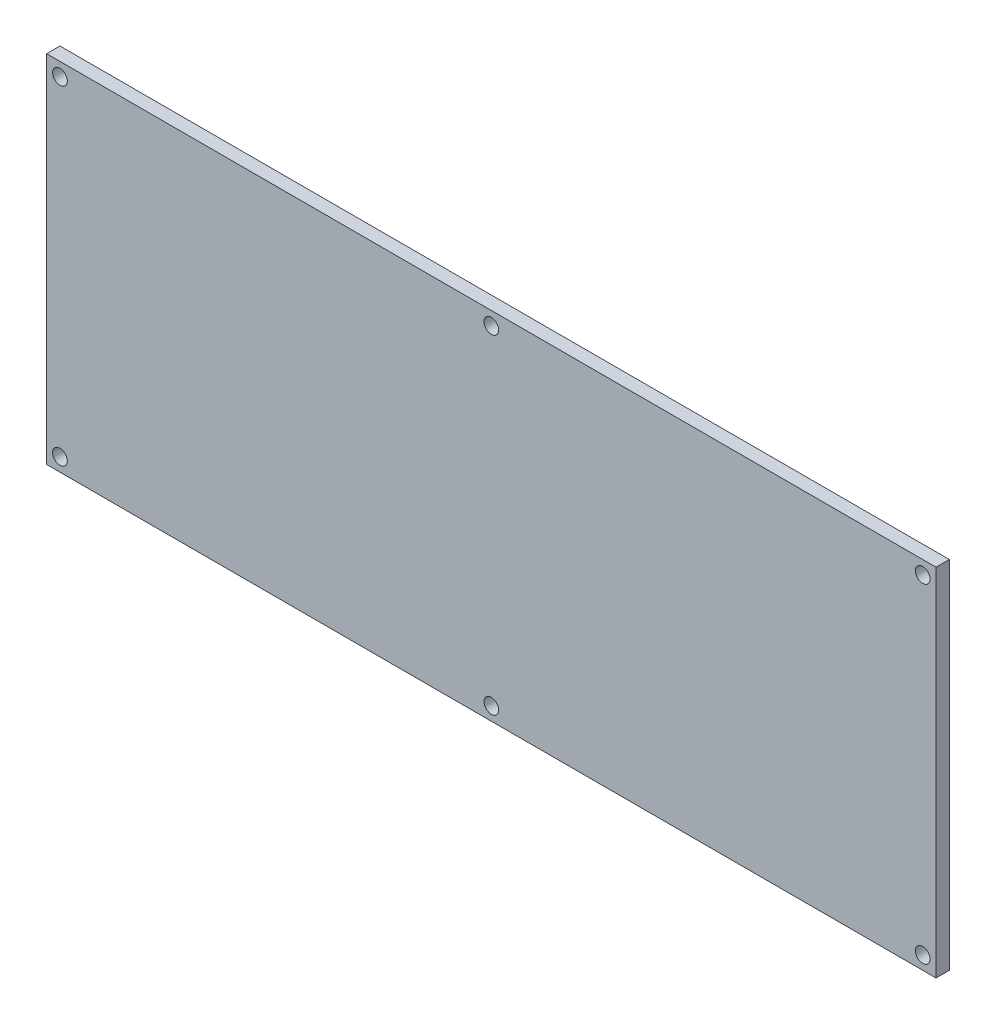
ISO-10303-21;
HEADER;
FILE_DESCRIPTION(('STEP AP214'),'2;1');
FILE_NAME('part.step','',(''),(''),'','','');
FILE_SCHEMA(('AUTOMOTIVE_DESIGN { 1 0 10303 214 1 1 1 1 }'));
ENDSEC;
DATA;
#1=APPLICATION_CONTEXT('core data for automotive mechanical design processes');
#2=APPLICATION_PROTOCOL_DEFINITION('international standard','automotive_design',2000,#1);
#3=PRODUCT_CONTEXT('',#1,'mechanical');
#4=PRODUCT('Part','Part','',(#3));
#5=PRODUCT_RELATED_PRODUCT_CATEGORY('part','',(#4));
#6=PRODUCT_DEFINITION_FORMATION('','',#4);
#7=PRODUCT_DEFINITION_CONTEXT('part definition',#1,'design');
#8=PRODUCT_DEFINITION('design','',#6,#7);
#9=PRODUCT_DEFINITION_SHAPE('','',#8);
#10=(LENGTH_UNIT() NAMED_UNIT(*) SI_UNIT(.MILLI.,.METRE.));
#11=(NAMED_UNIT(*) PLANE_ANGLE_UNIT() SI_UNIT($,.RADIAN.));
#12=(NAMED_UNIT(*) SI_UNIT($,.STERADIAN.) SOLID_ANGLE_UNIT());
#13=UNCERTAINTY_MEASURE_WITH_UNIT(LENGTH_MEASURE(1.E-05),#10,'distance_accuracy_value','');
#14=(GEOMETRIC_REPRESENTATION_CONTEXT(3) GLOBAL_UNCERTAINTY_ASSIGNED_CONTEXT((#13)) GLOBAL_UNIT_ASSIGNED_CONTEXT((#10,
#11,#12)) REPRESENTATION_CONTEXT('',''));
#15=CARTESIAN_POINT('',(0.,0.,0.));
#16=DIRECTION('',(0.,0.,1.));
#17=DIRECTION('',(1.,0.,0.));
#18=AXIS2_PLACEMENT_3D('',#15,#16,#17);
#19=CARTESIAN_POINT('',(0.,0.,3.));
#20=DIRECTION('',(0.,0.,-1.));
#21=DIRECTION('',(-1.,0.,0.));
#22=AXIS2_PLACEMENT_3D('',#19,#20,#21);
#23=PLANE('',#22);
#24=DIRECTION('',(0.,-1.,0.));
#25=VECTOR('',#24,1.);
#26=CARTESIAN_POINT('',(-100.,40.,3.));
#27=LINE('',#26,#25);
#28=CARTESIAN_POINT('',(-100.,40.,3.));
#29=VERTEX_POINT('',#28);
#30=CARTESIAN_POINT('',(-100.,-40.,3.));
#31=VERTEX_POINT('',#30);
#32=EDGE_CURVE('E87',#29,#31,#27,.T.);
#33=ORIENTED_EDGE('',*,*,#32,.T.);
#34=DIRECTION('',(1.,0.,0.));
#35=VECTOR('',#34,1.);
#36=CARTESIAN_POINT('',(100.,-40.,3.));
#37=LINE('',#36,#35);
#38=CARTESIAN_POINT('',(100.,-40.,3.));
#39=VERTEX_POINT('',#38);
#40=EDGE_CURVE('E82',#31,#39,#37,.T.);
#41=ORIENTED_EDGE('',*,*,#40,.T.);
#42=DIRECTION('',(0.,1.,0.));
#43=VECTOR('',#42,1.);
#44=CARTESIAN_POINT('',(100.,40.,3.));
#45=LINE('',#44,#43);
#46=CARTESIAN_POINT('',(100.,40.,3.));
#47=VERTEX_POINT('',#46);
#48=EDGE_CURVE('E85',#39,#47,#45,.T.);
#49=ORIENTED_EDGE('',*,*,#48,.T.);
#50=DIRECTION('',(-1.,0.,0.));
#51=VECTOR('',#50,1.);
#52=CARTESIAN_POINT('',(100.,40.,3.));
#53=LINE('',#52,#51);
#54=EDGE_CURVE('E52',#47,#29,#53,.T.);
#55=ORIENTED_EDGE('',*,*,#54,.T.);
#56=EDGE_LOOP('',(#33,#41,#49,#55));
#57=FACE_BOUND('',#56,.T.);
#58=CARTESIAN_POINT('',(-97.,37.,3.));
#59=DIRECTION('',(0.,0.,1.));
#60=DIRECTION('',(1.,0.,0.));
#61=AXIS2_PLACEMENT_3D('',#58,#59,#60);
#62=CIRCLE('',#61,1.65);
#63=CARTESIAN_POINT('',(-95.35,37.,3.));
#64=VERTEX_POINT('',#63);
#65=EDGE_CURVE('E102',#64,#64,#62,.T.);
#66=ORIENTED_EDGE('',*,*,#65,.F.);
#67=EDGE_LOOP('',(#66));
#68=FACE_BOUND('',#67,.T.);
#69=CARTESIAN_POINT('',(0.,37.,3.));
#70=DIRECTION('',(0.,0.,1.));
#71=DIRECTION('',(1.,0.,0.));
#72=AXIS2_PLACEMENT_3D('',#69,#70,#71);
#73=CIRCLE('',#72,1.65);
#74=CARTESIAN_POINT('',(1.65,37.,3.));
#75=VERTEX_POINT('',#74);
#76=EDGE_CURVE('E117',#75,#75,#73,.T.);
#77=ORIENTED_EDGE('',*,*,#76,.F.);
#78=EDGE_LOOP('',(#77));
#79=FACE_BOUND('',#78,.T.);
#80=CARTESIAN_POINT('',(97.,37.,3.));
#81=DIRECTION('',(0.,0.,1.));
#82=DIRECTION('',(1.,0.,0.));
#83=AXIS2_PLACEMENT_3D('',#80,#81,#82);
#84=CIRCLE('',#83,1.65);
#85=CARTESIAN_POINT('',(98.65,37.,3.));
#86=VERTEX_POINT('',#85);
#87=EDGE_CURVE('E123',#86,#86,#84,.T.);
#88=ORIENTED_EDGE('',*,*,#87,.F.);
#89=EDGE_LOOP('',(#88));
#90=FACE_BOUND('',#89,.T.);
#91=CARTESIAN_POINT('',(-97.,-37.,3.));
#92=DIRECTION('',(0.,0.,1.));
#93=DIRECTION('',(-1.,0.,0.));
#94=AXIS2_PLACEMENT_3D('',#91,#92,#93);
#95=CIRCLE('',#94,1.65);
#96=CARTESIAN_POINT('',(-98.65,-37.,3.));
#97=VERTEX_POINT('',#96);
#98=EDGE_CURVE('E129',#97,#97,#95,.T.);
#99=ORIENTED_EDGE('',*,*,#98,.F.);
#100=EDGE_LOOP('',(#99));
#101=FACE_BOUND('',#100,.T.);
#102=CARTESIAN_POINT('',(0.,-37.,3.));
#103=DIRECTION('',(0.,0.,1.));
#104=DIRECTION('',(-1.,0.,0.));
#105=AXIS2_PLACEMENT_3D('',#102,#103,#104);
#106=CIRCLE('',#105,1.65);
#107=CARTESIAN_POINT('',(-1.65,-37.,3.));
#108=VERTEX_POINT('',#107);
#109=EDGE_CURVE('E135',#108,#108,#106,.T.);
#110=ORIENTED_EDGE('',*,*,#109,.F.);
#111=EDGE_LOOP('',(#110));
#112=FACE_BOUND('',#111,.T.);
#113=CARTESIAN_POINT('',(97.,-37.,3.));
#114=DIRECTION('',(0.,0.,1.));
#115=DIRECTION('',(-1.,0.,0.));
#116=AXIS2_PLACEMENT_3D('',#113,#114,#115);
#117=CIRCLE('',#116,1.65);
#118=CARTESIAN_POINT('',(95.35,-37.,3.));
#119=VERTEX_POINT('',#118);
#120=EDGE_CURVE('E141',#119,#119,#117,.T.);
#121=ORIENTED_EDGE('',*,*,#120,.F.);
#122=EDGE_LOOP('',(#121));
#123=FACE_BOUND('',#122,.T.);
#124=ADVANCED_FACE('F35',(#57,#68,#79,#90,#101,#112,#123),#23,.F.);
#125=CARTESIAN_POINT('',(0.,0.,0.));
#126=DIRECTION('',(0.,0.,-1.));
#127=DIRECTION('',(-1.,0.,0.));
#128=AXIS2_PLACEMENT_3D('',#125,#126,#127);
#129=PLANE('',#128);
#130=CARTESIAN_POINT('',(0.,-37.,0.));
#131=DIRECTION('',(0.,0.,1.));
#132=DIRECTION('',(-1.,0.,0.));
#133=AXIS2_PLACEMENT_3D('',#130,#131,#132);
#134=CIRCLE('',#133,1.65);
#135=CARTESIAN_POINT('',(-1.65,-37.,0.));
#136=VERTEX_POINT('',#135);
#137=EDGE_CURVE('E138',#136,#136,#134,.T.);
#138=ORIENTED_EDGE('',*,*,#137,.T.);
#139=EDGE_LOOP('',(#138));
#140=FACE_BOUND('',#139,.T.);
#141=CARTESIAN_POINT('',(97.,37.,0.));
#142=DIRECTION('',(0.,0.,1.));
#143=DIRECTION('',(1.,0.,0.));
#144=AXIS2_PLACEMENT_3D('',#141,#142,#143);
#145=CIRCLE('',#144,1.65);
#146=CARTESIAN_POINT('',(98.65,37.,0.));
#147=VERTEX_POINT('',#146);
#148=EDGE_CURVE('E126',#147,#147,#145,.T.);
#149=ORIENTED_EDGE('',*,*,#148,.T.);
#150=EDGE_LOOP('',(#149));
#151=FACE_BOUND('',#150,.T.);
#152=CARTESIAN_POINT('',(-97.,37.,0.));
#153=DIRECTION('',(0.,0.,1.));
#154=DIRECTION('',(1.,0.,0.));
#155=AXIS2_PLACEMENT_3D('',#152,#153,#154);
#156=CIRCLE('',#155,1.65);
#157=CARTESIAN_POINT('',(-95.35,37.,0.));
#158=VERTEX_POINT('',#157);
#159=EDGE_CURVE('E114',#158,#158,#156,.T.);
#160=ORIENTED_EDGE('',*,*,#159,.T.);
#161=EDGE_LOOP('',(#160));
#162=FACE_BOUND('',#161,.T.);
#163=DIRECTION('',(0.,-1.,0.));
#164=VECTOR('',#163,1.);
#165=CARTESIAN_POINT('',(-100.,40.,0.));
#166=LINE('',#165,#164);
#167=CARTESIAN_POINT('',(-100.,40.,0.));
#168=VERTEX_POINT('',#167);
#169=CARTESIAN_POINT('',(-100.,-40.,0.));
#170=VERTEX_POINT('',#169);
#171=EDGE_CURVE('E99',#168,#170,#166,.T.);
#172=ORIENTED_EDGE('',*,*,#171,.F.);
#173=DIRECTION('',(-1.,0.,0.));
#174=VECTOR('',#173,1.);
#175=CARTESIAN_POINT('',(100.,40.,0.));
#176=LINE('',#175,#174);
#177=CARTESIAN_POINT('',(100.,40.,0.));
#178=VERTEX_POINT('',#177);
#179=EDGE_CURVE('E75',#178,#168,#176,.T.);
#180=ORIENTED_EDGE('',*,*,#179,.F.);
#181=DIRECTION('',(0.,1.,0.));
#182=VECTOR('',#181,1.);
#183=CARTESIAN_POINT('',(100.,40.,0.));
#184=LINE('',#183,#182);
#185=CARTESIAN_POINT('',(100.,-40.,0.));
#186=VERTEX_POINT('',#185);
#187=EDGE_CURVE('E69',#186,#178,#184,.T.);
#188=ORIENTED_EDGE('',*,*,#187,.F.);
#189=DIRECTION('',(1.,0.,0.));
#190=VECTOR('',#189,1.);
#191=CARTESIAN_POINT('',(100.,-40.,0.));
#192=LINE('',#191,#190);
#193=EDGE_CURVE('E91',#170,#186,#192,.T.);
#194=ORIENTED_EDGE('',*,*,#193,.F.);
#195=EDGE_LOOP('',(#172,#180,#188,#194));
#196=FACE_BOUND('',#195,.T.);
#197=CARTESIAN_POINT('',(0.,37.,0.));
#198=DIRECTION('',(0.,0.,1.));
#199=DIRECTION('',(1.,0.,0.));
#200=AXIS2_PLACEMENT_3D('',#197,#198,#199);
#201=CIRCLE('',#200,1.65);
#202=CARTESIAN_POINT('',(1.65,37.,0.));
#203=VERTEX_POINT('',#202);
#204=EDGE_CURVE('E120',#203,#203,#201,.T.);
#205=ORIENTED_EDGE('',*,*,#204,.T.);
#206=EDGE_LOOP('',(#205));
#207=FACE_BOUND('',#206,.T.);
#208=CARTESIAN_POINT('',(-97.,-37.,0.));
#209=DIRECTION('',(0.,0.,1.));
#210=DIRECTION('',(-1.,0.,0.));
#211=AXIS2_PLACEMENT_3D('',#208,#209,#210);
#212=CIRCLE('',#211,1.65);
#213=CARTESIAN_POINT('',(-98.65,-37.,0.));
#214=VERTEX_POINT('',#213);
#215=EDGE_CURVE('E132',#214,#214,#212,.T.);
#216=ORIENTED_EDGE('',*,*,#215,.T.);
#217=EDGE_LOOP('',(#216));
#218=FACE_BOUND('',#217,.T.);
#219=CARTESIAN_POINT('',(97.,-37.,0.));
#220=DIRECTION('',(0.,0.,1.));
#221=DIRECTION('',(-1.,0.,0.));
#222=AXIS2_PLACEMENT_3D('',#219,#220,#221);
#223=CIRCLE('',#222,1.65);
#224=CARTESIAN_POINT('',(95.35,-37.,0.));
#225=VERTEX_POINT('',#224);
#226=EDGE_CURVE('E144',#225,#225,#223,.T.);
#227=ORIENTED_EDGE('',*,*,#226,.T.);
#228=EDGE_LOOP('',(#227));
#229=FACE_BOUND('',#228,.T.);
#230=ADVANCED_FACE('F110',(#140,#151,#162,#196,#207,#218,#229),#129,.T.);
#231=CARTESIAN_POINT('',(-100.,40.,3.));
#232=DIRECTION('',(1.,0.,0.));
#233=DIRECTION('',(0.,1.,0.));
#234=AXIS2_PLACEMENT_3D('',#231,#232,#233);
#235=PLANE('',#234);
#236=ORIENTED_EDGE('',*,*,#171,.T.);
#237=DIRECTION('',(0.,0.,-1.));
#238=VECTOR('',#237,1.);
#239=CARTESIAN_POINT('',(-100.,-40.,3.));
#240=LINE('',#239,#238);
#241=EDGE_CURVE('E11',#31,#170,#240,.T.);
#242=ORIENTED_EDGE('',*,*,#241,.F.);
#243=ORIENTED_EDGE('',*,*,#32,.F.);
#244=DIRECTION('',(0.,0.,-1.));
#245=VECTOR('',#244,1.);
#246=CARTESIAN_POINT('',(-100.,40.,3.));
#247=LINE('',#246,#245);
#248=EDGE_CURVE('E95',#29,#168,#247,.T.);
#249=ORIENTED_EDGE('',*,*,#248,.T.);
#250=EDGE_LOOP('',(#236,#242,#243,#249));
#251=FACE_BOUND('',#250,.T.);
#252=ADVANCED_FACE('F37',(#251),#235,.F.);
#253=CARTESIAN_POINT('',(100.,-40.,3.));
#254=DIRECTION('',(0.,1.,0.));
#255=DIRECTION('',(-1.,0.,0.));
#256=AXIS2_PLACEMENT_3D('',#253,#254,#255);
#257=PLANE('',#256);
#258=ORIENTED_EDGE('',*,*,#193,.T.);
#259=DIRECTION('',(0.,0.,-1.));
#260=VECTOR('',#259,1.);
#261=CARTESIAN_POINT('',(100.,-40.,3.));
#262=LINE('',#261,#260);
#263=EDGE_CURVE('E44',#39,#186,#262,.T.);
#264=ORIENTED_EDGE('',*,*,#263,.F.);
#265=ORIENTED_EDGE('',*,*,#40,.F.);
#266=ORIENTED_EDGE('',*,*,#241,.T.);
#267=EDGE_LOOP('',(#258,#264,#265,#266));
#268=FACE_BOUND('',#267,.T.);
#269=ADVANCED_FACE('F90',(#268),#257,.F.);
#270=CARTESIAN_POINT('',(100.,40.,3.));
#271=DIRECTION('',(-1.,0.,0.));
#272=DIRECTION('',(0.,-1.,0.));
#273=AXIS2_PLACEMENT_3D('',#270,#271,#272);
#274=PLANE('',#273);
#275=ORIENTED_EDGE('',*,*,#187,.T.);
#276=DIRECTION('',(0.,0.,-1.));
#277=VECTOR('',#276,1.);
#278=CARTESIAN_POINT('',(100.,40.,3.));
#279=LINE('',#278,#277);
#280=EDGE_CURVE('E92',#47,#178,#279,.T.);
#281=ORIENTED_EDGE('',*,*,#280,.F.);
#282=ORIENTED_EDGE('',*,*,#48,.F.);
#283=ORIENTED_EDGE('',*,*,#263,.T.);
#284=EDGE_LOOP('',(#275,#281,#282,#283));
#285=FACE_BOUND('',#284,.T.);
#286=ADVANCED_FACE('F93',(#285),#274,.F.);
#287=CARTESIAN_POINT('',(100.,40.,3.));
#288=DIRECTION('',(0.,-1.,0.));
#289=DIRECTION('',(1.,0.,0.));
#290=AXIS2_PLACEMENT_3D('',#287,#288,#289);
#291=PLANE('',#290);
#292=ORIENTED_EDGE('',*,*,#179,.T.);
#293=ORIENTED_EDGE('',*,*,#248,.F.);
#294=ORIENTED_EDGE('',*,*,#54,.F.);
#295=ORIENTED_EDGE('',*,*,#280,.T.);
#296=EDGE_LOOP('',(#292,#293,#294,#295));
#297=FACE_BOUND('',#296,.T.);
#298=ADVANCED_FACE('F107',(#297),#291,.F.);
#299=CARTESIAN_POINT('',(-97.,37.,3.));
#300=DIRECTION('',(0.,0.,-1.));
#301=DIRECTION('',(-1.,0.,0.));
#302=AXIS2_PLACEMENT_3D('',#299,#300,#301);
#303=CYLINDRICAL_SURFACE('',#302,1.65);
#304=ORIENTED_EDGE('',*,*,#65,.T.);
#305=EDGE_LOOP('',(#304));
#306=FACE_BOUND('',#305,.T.);
#307=ORIENTED_EDGE('',*,*,#159,.F.);
#308=EDGE_LOOP('',(#307));
#309=FACE_BOUND('',#308,.T.);
#310=ADVANCED_FACE('F161',(#306,#309),#303,.F.);
#311=CARTESIAN_POINT('',(0.,37.,3.));
#312=DIRECTION('',(0.,0.,-1.));
#313=DIRECTION('',(-1.,0.,0.));
#314=AXIS2_PLACEMENT_3D('',#311,#312,#313);
#315=CYLINDRICAL_SURFACE('',#314,1.65);
#316=ORIENTED_EDGE('',*,*,#76,.T.);
#317=EDGE_LOOP('',(#316));
#318=FACE_BOUND('',#317,.T.);
#319=ORIENTED_EDGE('',*,*,#204,.F.);
#320=EDGE_LOOP('',(#319));
#321=FACE_BOUND('',#320,.T.);
#322=ADVANCED_FACE('F207',(#318,#321),#315,.F.);
#323=CARTESIAN_POINT('',(97.,37.,3.));
#324=DIRECTION('',(0.,0.,-1.));
#325=DIRECTION('',(-1.,0.,0.));
#326=AXIS2_PLACEMENT_3D('',#323,#324,#325);
#327=CYLINDRICAL_SURFACE('',#326,1.65);
#328=ORIENTED_EDGE('',*,*,#87,.T.);
#329=EDGE_LOOP('',(#328));
#330=FACE_BOUND('',#329,.T.);
#331=ORIENTED_EDGE('',*,*,#148,.F.);
#332=EDGE_LOOP('',(#331));
#333=FACE_BOUND('',#332,.T.);
#334=ADVANCED_FACE('F215',(#330,#333),#327,.F.);
#335=CARTESIAN_POINT('',(-97.,-37.,3.));
#336=DIRECTION('',(0.,0.,-1.));
#337=DIRECTION('',(-1.,0.,0.));
#338=AXIS2_PLACEMENT_3D('',#335,#336,#337);
#339=CYLINDRICAL_SURFACE('',#338,1.65);
#340=ORIENTED_EDGE('',*,*,#98,.T.);
#341=EDGE_LOOP('',(#340));
#342=FACE_BOUND('',#341,.T.);
#343=ORIENTED_EDGE('',*,*,#215,.F.);
#344=EDGE_LOOP('',(#343));
#345=FACE_BOUND('',#344,.T.);
#346=ADVANCED_FACE('F223',(#342,#345),#339,.F.);
#347=CARTESIAN_POINT('',(0.,-37.,3.));
#348=DIRECTION('',(0.,0.,-1.));
#349=DIRECTION('',(-1.,0.,0.));
#350=AXIS2_PLACEMENT_3D('',#347,#348,#349);
#351=CYLINDRICAL_SURFACE('',#350,1.65);
#352=ORIENTED_EDGE('',*,*,#109,.T.);
#353=EDGE_LOOP('',(#352));
#354=FACE_BOUND('',#353,.T.);
#355=ORIENTED_EDGE('',*,*,#137,.F.);
#356=EDGE_LOOP('',(#355));
#357=FACE_BOUND('',#356,.T.);
#358=ADVANCED_FACE('F232',(#354,#357),#351,.F.);
#359=CARTESIAN_POINT('',(97.,-37.,3.));
#360=DIRECTION('',(0.,0.,-1.));
#361=DIRECTION('',(-1.,0.,0.));
#362=AXIS2_PLACEMENT_3D('',#359,#360,#361);
#363=CYLINDRICAL_SURFACE('',#362,1.65);
#364=ORIENTED_EDGE('',*,*,#120,.T.);
#365=EDGE_LOOP('',(#364));
#366=FACE_BOUND('',#365,.T.);
#367=ORIENTED_EDGE('',*,*,#226,.F.);
#368=EDGE_LOOP('',(#367));
#369=FACE_BOUND('',#368,.T.);
#370=ADVANCED_FACE('F150',(#366,#369),#363,.F.);
#371=CLOSED_SHELL('',(#124,#230,#252,#269,#286,#298,#310,#322,#334,#346,#358,#370));
#372=MANIFOLD_SOLID_BREP('B2',#371);
#373=ADVANCED_BREP_SHAPE_REPRESENTATION('',(#18,#372),#14);
#374=SHAPE_DEFINITION_REPRESENTATION(#9,#373);
ENDSEC;
END-ISO-10303-21;
